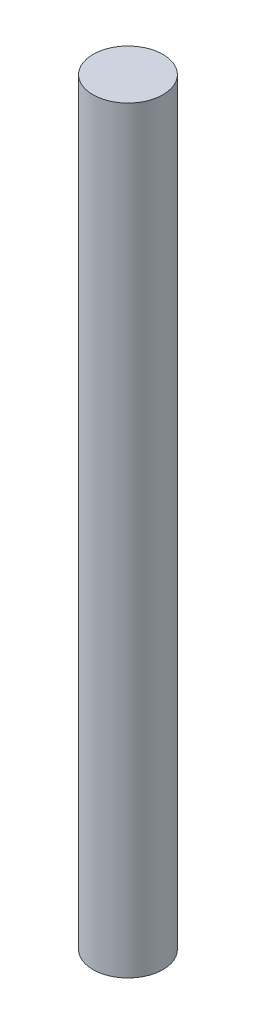
ISO-10303-21;
HEADER;
FILE_DESCRIPTION(('STEP AP214'),'2;1');
FILE_NAME('part.step','',(''),(''),'','','');
FILE_SCHEMA(('AUTOMOTIVE_DESIGN { 1 0 10303 214 1 1 1 1 }'));
ENDSEC;
DATA;
#1=APPLICATION_CONTEXT('core data for automotive mechanical design processes');
#2=APPLICATION_PROTOCOL_DEFINITION('international standard','automotive_design',2000,#1);
#3=PRODUCT_CONTEXT('',#1,'mechanical');
#4=PRODUCT('Part','Part','',(#3));
#5=PRODUCT_RELATED_PRODUCT_CATEGORY('part','',(#4));
#6=PRODUCT_DEFINITION_FORMATION('','',#4);
#7=PRODUCT_DEFINITION_CONTEXT('part definition',#1,'design');
#8=PRODUCT_DEFINITION('design','',#6,#7);
#9=PRODUCT_DEFINITION_SHAPE('','',#8);
#10=(LENGTH_UNIT() NAMED_UNIT(*) SI_UNIT(.MILLI.,.METRE.));
#11=(NAMED_UNIT(*) PLANE_ANGLE_UNIT() SI_UNIT($,.RADIAN.));
#12=(NAMED_UNIT(*) SI_UNIT($,.STERADIAN.) SOLID_ANGLE_UNIT());
#13=UNCERTAINTY_MEASURE_WITH_UNIT(LENGTH_MEASURE(1.E-05),#10,'distance_accuracy_value','');
#14=(GEOMETRIC_REPRESENTATION_CONTEXT(3) GLOBAL_UNCERTAINTY_ASSIGNED_CONTEXT((#13)) GLOBAL_UNIT_ASSIGNED_CONTEXT((#10,
#11,#12)) REPRESENTATION_CONTEXT('',''));
#15=CARTESIAN_POINT('',(0.,0.,0.));
#16=DIRECTION('',(0.,0.,1.));
#17=DIRECTION('',(1.,0.,0.));
#18=AXIS2_PLACEMENT_3D('',#15,#16,#17);
#19=CARTESIAN_POINT('',(0.,65.,0.));
#20=DIRECTION('',(0.,-1.,0.));
#21=DIRECTION('',(0.,0.,-1.));
#22=AXIS2_PLACEMENT_3D('',#19,#20,#21);
#23=CYLINDRICAL_SURFACE('',#22,3.);
#24=CARTESIAN_POINT('',(0.,65.,0.));
#25=DIRECTION('',(0.,1.,0.));
#26=DIRECTION('',(0.,0.,1.));
#27=AXIS2_PLACEMENT_3D('',#24,#25,#26);
#28=CIRCLE('',#27,3.);
#29=CARTESIAN_POINT('',(0.,65.,3.));
#30=VERTEX_POINT('',#29);
#31=EDGE_CURVE('E10',#30,#30,#28,.T.);
#32=ORIENTED_EDGE('',*,*,#31,.F.);
#33=EDGE_LOOP('',(#32));
#34=FACE_BOUND('',#33,.T.);
#35=CARTESIAN_POINT('',(0.,0.,0.));
#36=DIRECTION('',(0.,1.,0.));
#37=DIRECTION('',(0.,0.,1.));
#38=AXIS2_PLACEMENT_3D('',#35,#36,#37);
#39=CIRCLE('',#38,3.);
#40=CARTESIAN_POINT('',(0.,0.,3.));
#41=VERTEX_POINT('',#40);
#42=EDGE_CURVE('E32',#41,#41,#39,.T.);
#43=ORIENTED_EDGE('',*,*,#42,.T.);
#44=EDGE_LOOP('',(#43));
#45=FACE_BOUND('',#44,.T.);
#46=ADVANCED_FACE('F29',(#34,#45),#23,.T.);
#47=CARTESIAN_POINT('',(0.,65.,0.));
#48=DIRECTION('',(0.,1.,0.));
#49=DIRECTION('',(0.,0.,1.));
#50=AXIS2_PLACEMENT_3D('',#47,#48,#49);
#51=PLANE('',#50);
#52=ORIENTED_EDGE('',*,*,#31,.T.);
#53=EDGE_LOOP('',(#52));
#54=FACE_BOUND('',#53,.T.);
#55=ADVANCED_FACE('F44',(#54),#51,.T.);
#56=CARTESIAN_POINT('',(0.,0.,0.));
#57=DIRECTION('',(0.,1.,0.));
#58=DIRECTION('',(0.,0.,1.));
#59=AXIS2_PLACEMENT_3D('',#56,#57,#58);
#60=PLANE('',#59);
#61=ORIENTED_EDGE('',*,*,#42,.F.);
#62=EDGE_LOOP('',(#61));
#63=FACE_BOUND('',#62,.T.);
#64=ADVANCED_FACE('F42',(#63),#60,.F.);
#65=CLOSED_SHELL('',(#46,#55,#64));
#66=MANIFOLD_SOLID_BREP('B2',#65);
#67=ADVANCED_BREP_SHAPE_REPRESENTATION('',(#18,#66),#14);
#68=SHAPE_DEFINITION_REPRESENTATION(#9,#67);
ENDSEC;
END-ISO-10303-21;
